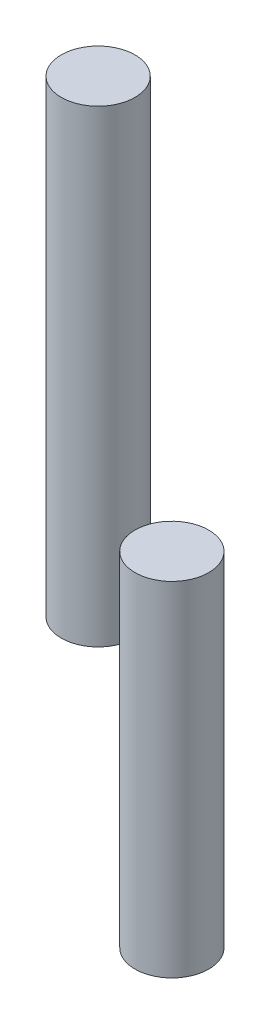
ISO-10303-21;
HEADER;
FILE_DESCRIPTION(('STEP AP214'),'2;1');
FILE_NAME('part.step','',(''),(''),'','','');
FILE_SCHEMA(('AUTOMOTIVE_DESIGN { 1 0 10303 214 1 1 1 1 }'));
ENDSEC;
DATA;
#1=APPLICATION_CONTEXT('core data for automotive mechanical design processes');
#2=APPLICATION_PROTOCOL_DEFINITION('international standard','automotive_design',2000,#1);
#3=PRODUCT_CONTEXT('',#1,'mechanical');
#4=PRODUCT('Part','Part','',(#3));
#5=PRODUCT_RELATED_PRODUCT_CATEGORY('part','',(#4));
#6=PRODUCT_DEFINITION_FORMATION('','',#4);
#7=PRODUCT_DEFINITION_CONTEXT('part definition',#1,'design');
#8=PRODUCT_DEFINITION('design','',#6,#7);
#9=PRODUCT_DEFINITION_SHAPE('','',#8);
#10=(LENGTH_UNIT() NAMED_UNIT(*) SI_UNIT(.MILLI.,.METRE.));
#11=(NAMED_UNIT(*) PLANE_ANGLE_UNIT() SI_UNIT($,.RADIAN.));
#12=(NAMED_UNIT(*) SI_UNIT($,.STERADIAN.) SOLID_ANGLE_UNIT());
#13=UNCERTAINTY_MEASURE_WITH_UNIT(LENGTH_MEASURE(1.E-05),#10,'distance_accuracy_value','');
#14=(GEOMETRIC_REPRESENTATION_CONTEXT(3) GLOBAL_UNCERTAINTY_ASSIGNED_CONTEXT((#13)) GLOBAL_UNIT_ASSIGNED_CONTEXT((#10,
#11,#12)) REPRESENTATION_CONTEXT('',''));
#15=CARTESIAN_POINT('',(0.,0.,0.));
#16=DIRECTION('',(0.,0.,1.));
#17=DIRECTION('',(1.,0.,0.));
#18=AXIS2_PLACEMENT_3D('',#15,#16,#17);
#19=CARTESIAN_POINT('',(60.,76.2,0.));
#20=DIRECTION('',(0.,-1.,0.));
#21=DIRECTION('',(0.,0.,-1.));
#22=AXIS2_PLACEMENT_3D('',#19,#20,#21);
#23=CYLINDRICAL_SURFACE('',#22,30.);
#24=CARTESIAN_POINT('',(60.,76.2,0.));
#25=DIRECTION('',(0.,-1.,0.));
#26=DIRECTION('',(0.,0.,-1.));
#27=AXIS2_PLACEMENT_3D('',#24,#25,#26);
#28=CIRCLE('',#27,30.);
#29=CARTESIAN_POINT('',(60.,76.2,-30.));
#30=VERTEX_POINT('',#29);
#31=EDGE_CURVE('E11',#30,#30,#28,.T.);
#32=ORIENTED_EDGE('',*,*,#31,.T.);
#33=EDGE_LOOP('',(#32));
#34=FACE_BOUND('',#33,.T.);
#35=CARTESIAN_POINT('',(60.,-203.2,0.));
#36=DIRECTION('',(0.,-1.,0.));
#37=DIRECTION('',(0.,0.,-1.));
#38=AXIS2_PLACEMENT_3D('',#35,#36,#37);
#39=CIRCLE('',#38,30.);
#40=CARTESIAN_POINT('',(60.,-203.2,-30.));
#41=VERTEX_POINT('',#40);
#42=EDGE_CURVE('E57',#41,#41,#39,.T.);
#43=ORIENTED_EDGE('',*,*,#42,.F.);
#44=EDGE_LOOP('',(#43));
#45=FACE_BOUND('',#44,.T.);
#46=ADVANCED_FACE('F51',(#34,#45),#23,.T.);
#47=CARTESIAN_POINT('',(60.,76.2,0.));
#48=DIRECTION('',(0.,-1.,0.));
#49=DIRECTION('',(0.,0.,-1.));
#50=AXIS2_PLACEMENT_3D('',#47,#48,#49);
#51=PLANE('',#50);
#52=ORIENTED_EDGE('',*,*,#31,.F.);
#53=EDGE_LOOP('',(#52));
#54=FACE_BOUND('',#53,.T.);
#55=ADVANCED_FACE('F66',(#54),#51,.F.);
#56=CARTESIAN_POINT('',(60.,-203.2,0.));
#57=DIRECTION('',(0.,-1.,0.));
#58=DIRECTION('',(0.,0.,-1.));
#59=AXIS2_PLACEMENT_3D('',#56,#57,#58);
#60=PLANE('',#59);
#61=ORIENTED_EDGE('',*,*,#42,.T.);
#62=EDGE_LOOP('',(#61));
#63=FACE_BOUND('',#62,.T.);
#64=ADVANCED_FACE('F63',(#63),#60,.T.);
#65=CLOSED_SHELL('',(#46,#55,#64));
#66=MANIFOLD_SOLID_BREP('B2',#65);
#67=CARTESIAN_POINT('',(0.,381.,0.));
#68=DIRECTION('',(0.,-1.,0.));
#69=DIRECTION('',(0.,0.,-1.));
#70=AXIS2_PLACEMENT_3D('',#67,#68,#69);
#71=CYLINDRICAL_SURFACE('',#70,30.);
#72=CARTESIAN_POINT('',(0.,381.,0.));
#73=DIRECTION('',(0.,1.,0.));
#74=DIRECTION('',(0.,0.,1.));
#75=AXIS2_PLACEMENT_3D('',#72,#73,#74);
#76=CIRCLE('',#75,30.);
#77=CARTESIAN_POINT('',(0.,381.,30.));
#78=VERTEX_POINT('',#77);
#79=EDGE_CURVE('E50',#78,#78,#76,.T.);
#80=ORIENTED_EDGE('',*,*,#79,.F.);
#81=EDGE_LOOP('',(#80));
#82=FACE_BOUND('',#81,.T.);
#83=CARTESIAN_POINT('',(0.,0.,0.));
#84=DIRECTION('',(0.,1.,0.));
#85=DIRECTION('',(0.,0.,1.));
#86=AXIS2_PLACEMENT_3D('',#83,#84,#85);
#87=CIRCLE('',#86,30.);
#88=CARTESIAN_POINT('',(0.,0.,30.));
#89=VERTEX_POINT('',#88);
#90=EDGE_CURVE('E95',#89,#89,#87,.T.);
#91=ORIENTED_EDGE('',*,*,#90,.T.);
#92=EDGE_LOOP('',(#91));
#93=FACE_BOUND('',#92,.T.);
#94=ADVANCED_FACE('F92',(#82,#93),#71,.T.);
#95=CARTESIAN_POINT('',(0.,381.,0.));
#96=DIRECTION('',(0.,1.,0.));
#97=DIRECTION('',(0.,0.,1.));
#98=AXIS2_PLACEMENT_3D('',#95,#96,#97);
#99=PLANE('',#98);
#100=ORIENTED_EDGE('',*,*,#79,.T.);
#101=EDGE_LOOP('',(#100));
#102=FACE_BOUND('',#101,.T.);
#103=ADVANCED_FACE('F109',(#102),#99,.T.);
#104=CARTESIAN_POINT('',(0.,0.,0.));
#105=DIRECTION('',(0.,1.,0.));
#106=DIRECTION('',(0.,0.,1.));
#107=AXIS2_PLACEMENT_3D('',#104,#105,#106);
#108=PLANE('',#107);
#109=ORIENTED_EDGE('',*,*,#90,.F.);
#110=EDGE_LOOP('',(#109));
#111=FACE_BOUND('',#110,.T.);
#112=ADVANCED_FACE('F107',(#111),#108,.F.);
#113=CLOSED_SHELL('',(#94,#103,#112));
#114=MANIFOLD_SOLID_BREP('B6',#113);
#115=ADVANCED_BREP_SHAPE_REPRESENTATION('',(#18,#66,#114),#14);
#116=SHAPE_DEFINITION_REPRESENTATION(#9,#115);
ENDSEC;
END-ISO-10303-21;
